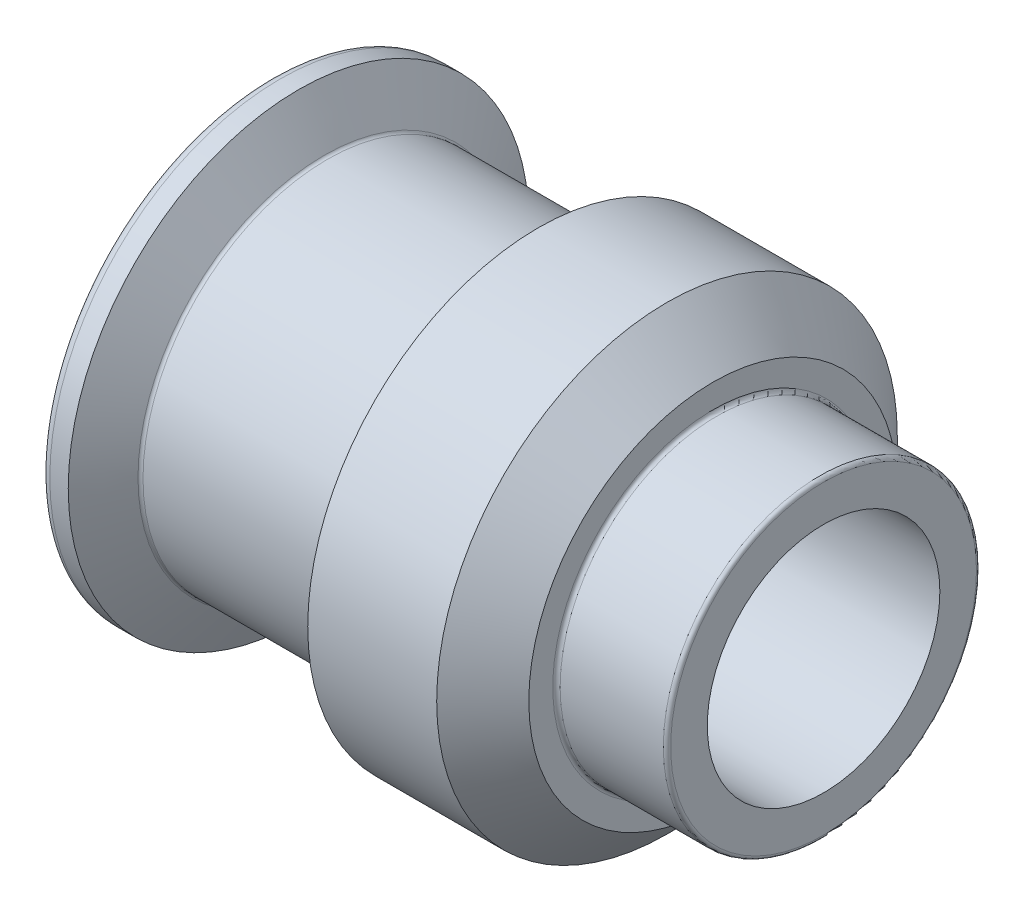
ISO-10303-21;
HEADER;
FILE_DESCRIPTION(('STEP AP214'),'2;1');
FILE_NAME('part.step','',(''),(''),'','','');
FILE_SCHEMA(('AUTOMOTIVE_DESIGN { 1 0 10303 214 1 1 1 1 }'));
ENDSEC;
DATA;
#1=APPLICATION_CONTEXT('core data for automotive mechanical design processes');
#2=APPLICATION_PROTOCOL_DEFINITION('international standard','automotive_design',2000,#1);
#3=PRODUCT_CONTEXT('',#1,'mechanical');
#4=PRODUCT('Part','Part','',(#3));
#5=PRODUCT_RELATED_PRODUCT_CATEGORY('part','',(#4));
#6=PRODUCT_DEFINITION_FORMATION('','',#4);
#7=PRODUCT_DEFINITION_CONTEXT('part definition',#1,'design');
#8=PRODUCT_DEFINITION('design','',#6,#7);
#9=PRODUCT_DEFINITION_SHAPE('','',#8);
#10=(LENGTH_UNIT() NAMED_UNIT(*) SI_UNIT(.MILLI.,.METRE.));
#11=(NAMED_UNIT(*) PLANE_ANGLE_UNIT() SI_UNIT($,.RADIAN.));
#12=(NAMED_UNIT(*) SI_UNIT($,.STERADIAN.) SOLID_ANGLE_UNIT());
#13=UNCERTAINTY_MEASURE_WITH_UNIT(LENGTH_MEASURE(1.E-05),#10,'distance_accuracy_value','');
#14=(GEOMETRIC_REPRESENTATION_CONTEXT(3) GLOBAL_UNCERTAINTY_ASSIGNED_CONTEXT((#13)) GLOBAL_UNIT_ASSIGNED_CONTEXT((#10,
#11,#12)) REPRESENTATION_CONTEXT('',''));
#15=CARTESIAN_POINT('',(0.,0.,0.));
#16=DIRECTION('',(0.,0.,1.));
#17=DIRECTION('',(1.,0.,0.));
#18=AXIS2_PLACEMENT_3D('',#15,#16,#17);
#19=CARTESIAN_POINT('',(0.,0.,0.));
#20=DIRECTION('',(1.,0.,0.));
#21=DIRECTION('',(0.,0.,-1.));
#22=AXIS2_PLACEMENT_3D('',#19,#20,#21);
#23=CYLINDRICAL_SURFACE('',#22,6.99999999999999);
#24=CARTESIAN_POINT('',(-30.2475952641916,0.,0.));
#25=DIRECTION('',(1.,0.,0.));
#26=DIRECTION('',(0.,0.,-1.));
#27=AXIS2_PLACEMENT_3D('',#24,#25,#26);
#28=CIRCLE('',#27,7.);
#29=CARTESIAN_POINT('',(-30.2475952641916,0.,-7.));
#30=VERTEX_POINT('',#29);
#31=EDGE_CURVE('E10',#30,#30,#28,.T.);
#32=ORIENTED_EDGE('',*,*,#31,.T.);
#33=EDGE_LOOP('',(#32));
#34=FACE_BOUND('',#33,.T.);
#35=CARTESIAN_POINT('',(-60.,0.,0.));
#36=DIRECTION('',(1.,0.,0.));
#37=DIRECTION('',(0.,0.,-1.));
#38=AXIS2_PLACEMENT_3D('',#35,#36,#37);
#39=CIRCLE('',#38,6.99999999999999);
#40=CARTESIAN_POINT('',(-60.,0.,-6.99999999999999));
#41=VERTEX_POINT('',#40);
#42=EDGE_CURVE('E101',#41,#41,#39,.T.);
#43=ORIENTED_EDGE('',*,*,#42,.F.);
#44=EDGE_LOOP('',(#43));
#45=FACE_BOUND('',#44,.T.);
#46=ADVANCED_FACE('F43',(#34,#45),#23,.F.);
#47=CARTESIAN_POINT('',(-30.2475952641916,0.,0.));
#48=DIRECTION('',(1.,0.,0.));
#49=DIRECTION('',(0.,0.,-1.));
#50=AXIS2_PLACEMENT_3D('',#47,#48,#49);
#51=CONICAL_SURFACE('',#50,7.,1.0471975511966);
#52=CARTESIAN_POINT('',(-27.,0.,0.));
#53=DIRECTION('',(1.,0.,0.));
#54=DIRECTION('',(0.,0.,-1.));
#55=AXIS2_PLACEMENT_3D('',#52,#53,#54);
#56=CIRCLE('',#55,12.625);
#57=CARTESIAN_POINT('',(-27.,0.,-12.625));
#58=VERTEX_POINT('',#57);
#59=EDGE_CURVE('E49',#58,#58,#56,.T.);
#60=ORIENTED_EDGE('',*,*,#59,.T.);
#61=EDGE_LOOP('',(#60));
#62=FACE_BOUND('',#61,.T.);
#63=ORIENTED_EDGE('',*,*,#31,.F.);
#64=EDGE_LOOP('',(#63));
#65=FACE_BOUND('',#64,.T.);
#66=ADVANCED_FACE('F109',(#62,#65),#51,.F.);
#67=CARTESIAN_POINT('',(0.,0.,0.));
#68=DIRECTION('',(1.,0.,0.));
#69=DIRECTION('',(0.,0.,-1.));
#70=AXIS2_PLACEMENT_3D('',#67,#68,#69);
#71=CYLINDRICAL_SURFACE('',#70,12.625);
#72=CARTESIAN_POINT('',(0.,0.,0.));
#73=DIRECTION('',(1.,0.,0.));
#74=DIRECTION('',(0.,0.,-1.));
#75=AXIS2_PLACEMENT_3D('',#72,#73,#74);
#76=CIRCLE('',#75,12.625);
#77=CARTESIAN_POINT('',(0.,0.,-12.625));
#78=VERTEX_POINT('',#77);
#79=EDGE_CURVE('E53',#78,#78,#76,.T.);
#80=ORIENTED_EDGE('',*,*,#79,.T.);
#81=EDGE_LOOP('',(#80));
#82=FACE_BOUND('',#81,.T.);
#83=ORIENTED_EDGE('',*,*,#59,.F.);
#84=EDGE_LOOP('',(#83));
#85=FACE_BOUND('',#84,.T.);
#86=ADVANCED_FACE('F113',(#82,#85),#71,.F.);
#87=CARTESIAN_POINT('',(0.,12.625,0.));
#88=DIRECTION('',(1.,0.,0.));
#89=DIRECTION('',(0.,0.,-1.));
#90=AXIS2_PLACEMENT_3D('',#87,#88,#89);
#91=PLANE('',#90);
#92=CARTESIAN_POINT('',(0.,0.,0.));
#93=DIRECTION('',(1.,0.,0.));
#94=DIRECTION('',(0.,0.,-1.));
#95=AXIS2_PLACEMENT_3D('',#92,#93,#94);
#96=CIRCLE('',#95,16.6);
#97=CARTESIAN_POINT('',(0.,0.,-16.6));
#98=VERTEX_POINT('',#97);
#99=EDGE_CURVE('E57',#98,#98,#96,.T.);
#100=ORIENTED_EDGE('',*,*,#99,.T.);
#101=EDGE_LOOP('',(#100));
#102=FACE_BOUND('',#101,.T.);
#103=ORIENTED_EDGE('',*,*,#79,.F.);
#104=EDGE_LOOP('',(#103));
#105=FACE_BOUND('',#104,.T.);
#106=ADVANCED_FACE('F118',(#102,#105),#91,.T.);
#107=CARTESIAN_POINT('',(-0.4,0.,0.));
#108=DIRECTION('',(1.,0.,0.));
#109=DIRECTION('',(0.,0.,-1.));
#110=AXIS2_PLACEMENT_3D('',#107,#108,#109);
#111=TOROIDAL_SURFACE('',#110,16.6,0.400000000000002);
#112=CARTESIAN_POINT('',(-0.4,0.,0.));
#113=DIRECTION('',(1.,0.,0.));
#114=DIRECTION('',(0.,0.,-1.));
#115=AXIS2_PLACEMENT_3D('',#112,#113,#114);
#116=CIRCLE('',#115,17.);
#117=CARTESIAN_POINT('',(-0.4,0.,-17.));
#118=VERTEX_POINT('',#117);
#119=EDGE_CURVE('E62',#118,#118,#116,.T.);
#120=ORIENTED_EDGE('',*,*,#119,.T.);
#121=EDGE_LOOP('',(#120));
#122=FACE_BOUND('',#121,.T.);
#123=ORIENTED_EDGE('',*,*,#99,.F.);
#124=EDGE_LOOP('',(#123));
#125=FACE_BOUND('',#124,.T.);
#126=ADVANCED_FACE('F125',(#122,#125),#111,.T.);
#127=CARTESIAN_POINT('',(0.,0.,0.));
#128=DIRECTION('',(1.,0.,0.));
#129=DIRECTION('',(0.,0.,-1.));
#130=AXIS2_PLACEMENT_3D('',#127,#128,#129);
#131=CYLINDRICAL_SURFACE('',#130,17.);
#132=CARTESIAN_POINT('',(-11.6,0.,0.));
#133=DIRECTION('',(1.,0.,0.));
#134=DIRECTION('',(0.,0.,-1.));
#135=AXIS2_PLACEMENT_3D('',#132,#133,#134);
#136=CIRCLE('',#135,17.);
#137=CARTESIAN_POINT('',(-11.6,0.,-17.));
#138=VERTEX_POINT('',#137);
#139=EDGE_CURVE('E65',#138,#138,#136,.T.);
#140=ORIENTED_EDGE('',*,*,#139,.T.);
#141=EDGE_LOOP('',(#140));
#142=FACE_BOUND('',#141,.T.);
#143=ORIENTED_EDGE('',*,*,#119,.F.);
#144=EDGE_LOOP('',(#143));
#145=FACE_BOUND('',#144,.T.);
#146=ADVANCED_FACE('F129',(#142,#145),#131,.T.);
#147=CARTESIAN_POINT('',(-11.6,0.,0.));
#148=DIRECTION('',(1.,0.,0.));
#149=DIRECTION('',(0.,0.,-1.));
#150=AXIS2_PLACEMENT_3D('',#147,#148,#149);
#151=TOROIDAL_SURFACE('',#150,17.4,0.399999999999998);
#152=CARTESIAN_POINT('',(-12.,0.,0.));
#153=DIRECTION('',(1.,0.,0.));
#154=DIRECTION('',(0.,0.,-1.));
#155=AXIS2_PLACEMENT_3D('',#152,#153,#154);
#156=CIRCLE('',#155,17.4);
#157=CARTESIAN_POINT('',(-12.,0.,-17.4));
#158=VERTEX_POINT('',#157);
#159=EDGE_CURVE('E68',#158,#158,#156,.T.);
#160=ORIENTED_EDGE('',*,*,#159,.T.);
#161=EDGE_LOOP('',(#160));
#162=FACE_BOUND('',#161,.T.);
#163=ORIENTED_EDGE('',*,*,#139,.F.);
#164=EDGE_LOOP('',(#163));
#165=FACE_BOUND('',#164,.T.);
#166=ADVANCED_FACE('F133',(#162,#165),#151,.F.);
#167=CARTESIAN_POINT('',(-12.,17.4,0.));
#168=DIRECTION('',(1.,0.,0.));
#169=DIRECTION('',(0.,0.,-1.));
#170=AXIS2_PLACEMENT_3D('',#167,#168,#169);
#171=PLANE('',#170);
#172=CARTESIAN_POINT('',(-12.,0.,0.));
#173=DIRECTION('',(1.,0.,0.));
#174=DIRECTION('',(0.,0.,-1.));
#175=AXIS2_PLACEMENT_3D('',#172,#173,#174);
#176=CIRCLE('',#175,20.0000000000001);
#177=CARTESIAN_POINT('',(-12.,0.,-20.0000000000001));
#178=VERTEX_POINT('',#177);
#179=EDGE_CURVE('E71',#178,#178,#176,.T.);
#180=ORIENTED_EDGE('',*,*,#179,.T.);
#181=EDGE_LOOP('',(#180));
#182=FACE_BOUND('',#181,.T.);
#183=ORIENTED_EDGE('',*,*,#159,.F.);
#184=EDGE_LOOP('',(#183));
#185=FACE_BOUND('',#184,.T.);
#186=ADVANCED_FACE('F137',(#182,#185),#171,.T.);
#187=CARTESIAN_POINT('',(-12.,0.,0.));
#188=DIRECTION('',(-1.,0.,0.));
#189=DIRECTION('',(0.,0.,1.));
#190=AXIS2_PLACEMENT_3D('',#187,#188,#189);
#191=CONICAL_SURFACE('',#190,20.0000000000001,0.785398163397443);
#192=CARTESIAN_POINT('',(-17.,0.,0.));
#193=DIRECTION('',(1.,0.,0.));
#194=DIRECTION('',(0.,0.,-1.));
#195=AXIS2_PLACEMENT_3D('',#192,#193,#194);
#196=CIRCLE('',#195,25.);
#197=CARTESIAN_POINT('',(-17.,0.,-25.));
#198=VERTEX_POINT('',#197);
#199=EDGE_CURVE('E74',#198,#198,#196,.T.);
#200=ORIENTED_EDGE('',*,*,#199,.T.);
#201=EDGE_LOOP('',(#200));
#202=FACE_BOUND('',#201,.T.);
#203=ORIENTED_EDGE('',*,*,#179,.F.);
#204=EDGE_LOOP('',(#203));
#205=FACE_BOUND('',#204,.T.);
#206=ADVANCED_FACE('F141',(#202,#205),#191,.T.);
#207=CARTESIAN_POINT('',(0.,0.,0.));
#208=DIRECTION('',(1.,0.,0.));
#209=DIRECTION('',(0.,0.,-1.));
#210=AXIS2_PLACEMENT_3D('',#207,#208,#209);
#211=CYLINDRICAL_SURFACE('',#210,25.);
#212=CARTESIAN_POINT('',(-31.,0.,0.));
#213=DIRECTION('',(1.,0.,0.));
#214=DIRECTION('',(0.,0.,-1.));
#215=AXIS2_PLACEMENT_3D('',#212,#213,#214);
#216=CIRCLE('',#215,25.);
#217=CARTESIAN_POINT('',(-31.,0.,-25.));
#218=VERTEX_POINT('',#217);
#219=EDGE_CURVE('E77',#218,#218,#216,.T.);
#220=ORIENTED_EDGE('',*,*,#219,.T.);
#221=EDGE_LOOP('',(#220));
#222=FACE_BOUND('',#221,.T.);
#223=ORIENTED_EDGE('',*,*,#199,.F.);
#224=EDGE_LOOP('',(#223));
#225=FACE_BOUND('',#224,.T.);
#226=ADVANCED_FACE('F145',(#222,#225),#211,.T.);
#227=CARTESIAN_POINT('',(-31.,0.,0.));
#228=DIRECTION('',(1.,0.,0.));
#229=DIRECTION('',(0.,0.,-1.));
#230=AXIS2_PLACEMENT_3D('',#227,#228,#229);
#231=CONICAL_SURFACE('',#230,25.,1.0471975511966);
#232=CARTESIAN_POINT('',(-33.7712812921102,0.,0.));
#233=DIRECTION('',(1.,0.,0.));
#234=DIRECTION('',(0.,0.,-1.));
#235=AXIS2_PLACEMENT_3D('',#232,#233,#234);
#236=CIRCLE('',#235,20.2);
#237=CARTESIAN_POINT('',(-33.7712812921102,0.,-20.2));
#238=VERTEX_POINT('',#237);
#239=EDGE_CURVE('E80',#238,#238,#236,.T.);
#240=ORIENTED_EDGE('',*,*,#239,.T.);
#241=EDGE_LOOP('',(#240));
#242=FACE_BOUND('',#241,.T.);
#243=ORIENTED_EDGE('',*,*,#219,.F.);
#244=EDGE_LOOP('',(#243));
#245=FACE_BOUND('',#244,.T.);
#246=ADVANCED_FACE('F149',(#242,#245),#231,.T.);
#247=CARTESIAN_POINT('',(-34.1176914536239,0.,0.));
#248=DIRECTION('',(1.,0.,0.));
#249=DIRECTION('',(0.,0.,-1.));
#250=AXIS2_PLACEMENT_3D('',#247,#248,#249);
#251=TOROIDAL_SURFACE('',#250,20.4,0.400000000000002);
#252=CARTESIAN_POINT('',(-34.1176914536239,0.,0.));
#253=DIRECTION('',(1.,0.,0.));
#254=DIRECTION('',(0.,0.,-1.));
#255=AXIS2_PLACEMENT_3D('',#252,#253,#254);
#256=CIRCLE('',#255,20.);
#257=CARTESIAN_POINT('',(-34.1176914536239,0.,-20.));
#258=VERTEX_POINT('',#257);
#259=EDGE_CURVE('E83',#258,#258,#256,.T.);
#260=ORIENTED_EDGE('',*,*,#259,.T.);
#261=EDGE_LOOP('',(#260));
#262=FACE_BOUND('',#261,.T.);
#263=ORIENTED_EDGE('',*,*,#239,.F.);
#264=EDGE_LOOP('',(#263));
#265=FACE_BOUND('',#264,.T.);
#266=ADVANCED_FACE('F153',(#262,#265),#251,.F.);
#267=CARTESIAN_POINT('',(0.,0.,0.));
#268=DIRECTION('',(1.,0.,0.));
#269=DIRECTION('',(0.,0.,-1.));
#270=AXIS2_PLACEMENT_3D('',#267,#268,#269);
#271=CYLINDRICAL_SURFACE('',#270,20.);
#272=CARTESIAN_POINT('',(-53.882308546376,0.,0.));
#273=DIRECTION('',(1.,0.,0.));
#274=DIRECTION('',(0.,0.,-1.));
#275=AXIS2_PLACEMENT_3D('',#272,#273,#274);
#276=CIRCLE('',#275,20.);
#277=CARTESIAN_POINT('',(-53.882308546376,0.,-20.));
#278=VERTEX_POINT('',#277);
#279=EDGE_CURVE('E86',#278,#278,#276,.T.);
#280=ORIENTED_EDGE('',*,*,#279,.T.);
#281=EDGE_LOOP('',(#280));
#282=FACE_BOUND('',#281,.T.);
#283=ORIENTED_EDGE('',*,*,#259,.F.);
#284=EDGE_LOOP('',(#283));
#285=FACE_BOUND('',#284,.T.);
#286=ADVANCED_FACE('F157',(#282,#285),#271,.T.);
#287=CARTESIAN_POINT('',(-53.882308546376,0.,0.));
#288=DIRECTION('',(1.,0.,0.));
#289=DIRECTION('',(0.,0.,-1.));
#290=AXIS2_PLACEMENT_3D('',#287,#288,#289);
#291=TOROIDAL_SURFACE('',#290,20.4,0.399999999999997);
#292=CARTESIAN_POINT('',(-54.2287187078898,0.,0.));
#293=DIRECTION('',(1.,0.,0.));
#294=DIRECTION('',(0.,0.,-1.));
#295=AXIS2_PLACEMENT_3D('',#292,#293,#294);
#296=CIRCLE('',#295,20.2);
#297=CARTESIAN_POINT('',(-54.2287187078898,0.,-20.2));
#298=VERTEX_POINT('',#297);
#299=EDGE_CURVE('E89',#298,#298,#296,.T.);
#300=ORIENTED_EDGE('',*,*,#299,.T.);
#301=EDGE_LOOP('',(#300));
#302=FACE_BOUND('',#301,.T.);
#303=ORIENTED_EDGE('',*,*,#279,.F.);
#304=EDGE_LOOP('',(#303));
#305=FACE_BOUND('',#304,.T.);
#306=ADVANCED_FACE('F161',(#302,#305),#291,.F.);
#307=CARTESIAN_POINT('',(-54.2287187078898,0.,0.));
#308=DIRECTION('',(-1.,0.,0.));
#309=DIRECTION('',(0.,0.,1.));
#310=AXIS2_PLACEMENT_3D('',#307,#308,#309);
#311=CONICAL_SURFACE('',#310,20.2,1.0471975511966);
#312=CARTESIAN_POINT('',(-57.,0.,0.));
#313=DIRECTION('',(1.,0.,0.));
#314=DIRECTION('',(0.,0.,-1.));
#315=AXIS2_PLACEMENT_3D('',#312,#313,#314);
#316=CIRCLE('',#315,25.);
#317=CARTESIAN_POINT('',(-57.,0.,-25.));
#318=VERTEX_POINT('',#317);
#319=EDGE_CURVE('E92',#318,#318,#316,.T.);
#320=ORIENTED_EDGE('',*,*,#319,.T.);
#321=EDGE_LOOP('',(#320));
#322=FACE_BOUND('',#321,.T.);
#323=ORIENTED_EDGE('',*,*,#299,.F.);
#324=EDGE_LOOP('',(#323));
#325=FACE_BOUND('',#324,.T.);
#326=ADVANCED_FACE('F165',(#322,#325),#311,.T.);
#327=CARTESIAN_POINT('',(0.,0.,0.));
#328=DIRECTION('',(1.,0.,0.));
#329=DIRECTION('',(0.,0.,-1.));
#330=AXIS2_PLACEMENT_3D('',#327,#328,#329);
#331=CYLINDRICAL_SURFACE('',#330,25.);
#332=CARTESIAN_POINT('',(-59.,0.,0.));
#333=DIRECTION('',(1.,0.,0.));
#334=DIRECTION('',(0.,0.,-1.));
#335=AXIS2_PLACEMENT_3D('',#332,#333,#334);
#336=CIRCLE('',#335,25.);
#337=CARTESIAN_POINT('',(-59.,0.,-25.));
#338=VERTEX_POINT('',#337);
#339=EDGE_CURVE('E95',#338,#338,#336,.T.);
#340=ORIENTED_EDGE('',*,*,#339,.T.);
#341=EDGE_LOOP('',(#340));
#342=FACE_BOUND('',#341,.T.);
#343=ORIENTED_EDGE('',*,*,#319,.F.);
#344=EDGE_LOOP('',(#343));
#345=FACE_BOUND('',#344,.T.);
#346=ADVANCED_FACE('F169',(#342,#345),#331,.T.);
#347=CARTESIAN_POINT('',(-59.,0.,0.));
#348=DIRECTION('',(1.,0.,0.));
#349=DIRECTION('',(0.,0.,-1.));
#350=AXIS2_PLACEMENT_3D('',#347,#348,#349);
#351=TOROIDAL_SURFACE('',#350,24.,1.);
#352=CARTESIAN_POINT('',(-60.,0.,0.));
#353=DIRECTION('',(1.,0.,0.));
#354=DIRECTION('',(0.,0.,-1.));
#355=AXIS2_PLACEMENT_3D('',#352,#353,#354);
#356=CIRCLE('',#355,24.);
#357=CARTESIAN_POINT('',(-60.,0.,-24.));
#358=VERTEX_POINT('',#357);
#359=EDGE_CURVE('E98',#358,#358,#356,.T.);
#360=ORIENTED_EDGE('',*,*,#359,.T.);
#361=EDGE_LOOP('',(#360));
#362=FACE_BOUND('',#361,.T.);
#363=ORIENTED_EDGE('',*,*,#339,.F.);
#364=EDGE_LOOP('',(#363));
#365=FACE_BOUND('',#364,.T.);
#366=ADVANCED_FACE('F173',(#362,#365),#351,.T.);
#367=CARTESIAN_POINT('',(-60.,24.,0.));
#368=DIRECTION('',(-1.,0.,0.));
#369=DIRECTION('',(0.,0.,1.));
#370=AXIS2_PLACEMENT_3D('',#367,#368,#369);
#371=PLANE('',#370);
#372=ORIENTED_EDGE('',*,*,#42,.T.);
#373=EDGE_LOOP('',(#372));
#374=FACE_BOUND('',#373,.T.);
#375=ORIENTED_EDGE('',*,*,#359,.F.);
#376=EDGE_LOOP('',(#375));
#377=FACE_BOUND('',#376,.T.);
#378=ADVANCED_FACE('F105',(#374,#377),#371,.T.);
#379=CLOSED_SHELL('',(#46,#66,#86,#106,#126,#146,#166,#186,#206,#226,#246,#266,#286,#306,#326,
#346,#366,#378));
#380=MANIFOLD_SOLID_BREP('B2',#379);
#381=ADVANCED_BREP_SHAPE_REPRESENTATION('',(#18,#380),#14);
#382=SHAPE_DEFINITION_REPRESENTATION(#9,#381);
ENDSEC;
END-ISO-10303-21;
